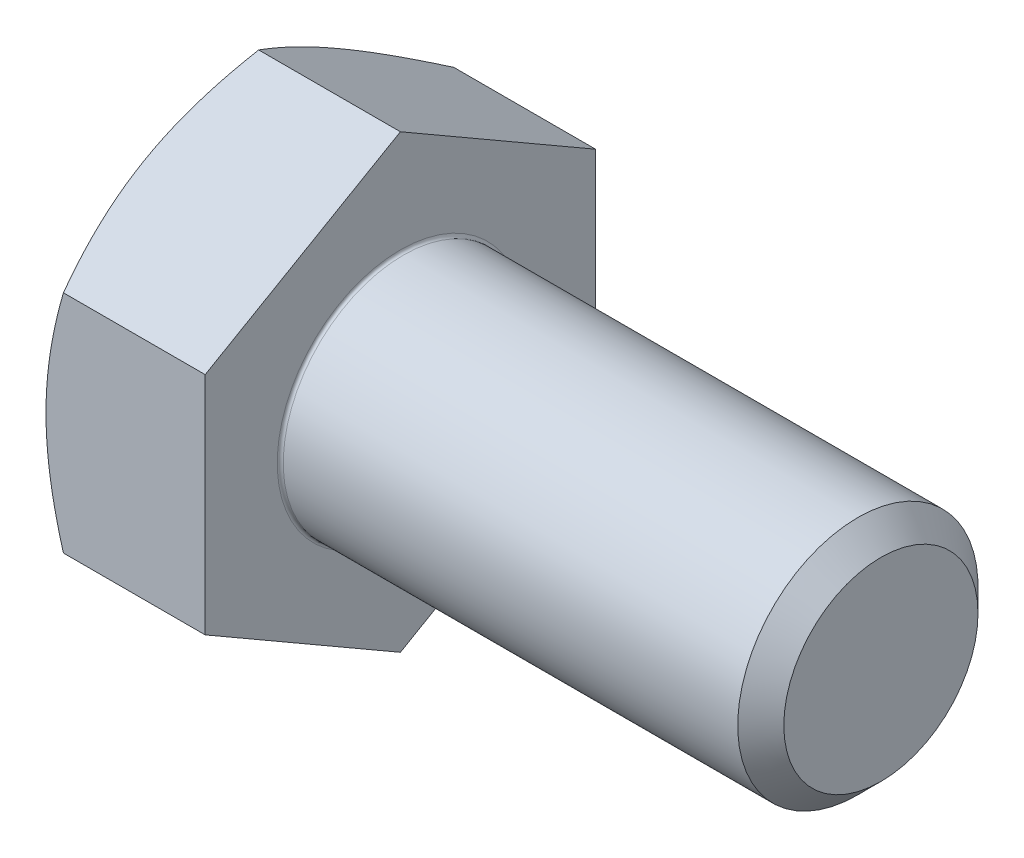
ISO-10303-21;
HEADER;
FILE_DESCRIPTION(('STEP AP214'),'2;1');
FILE_NAME('part.step','',(''),(''),'','','');
FILE_SCHEMA(('AUTOMOTIVE_DESIGN { 1 0 10303 214 1 1 1 1 }'));
ENDSEC;
DATA;
#1=APPLICATION_CONTEXT('core data for automotive mechanical design processes');
#2=APPLICATION_PROTOCOL_DEFINITION('international standard','automotive_design',2000,#1);
#3=PRODUCT_CONTEXT('',#1,'mechanical');
#4=PRODUCT('Part','Part','',(#3));
#5=PRODUCT_RELATED_PRODUCT_CATEGORY('part','',(#4));
#6=PRODUCT_DEFINITION_FORMATION('','',#4);
#7=PRODUCT_DEFINITION_CONTEXT('part definition',#1,'design');
#8=PRODUCT_DEFINITION('design','',#6,#7);
#9=PRODUCT_DEFINITION_SHAPE('','',#8);
#10=(LENGTH_UNIT() NAMED_UNIT(*) SI_UNIT(.MILLI.,.METRE.));
#11=(NAMED_UNIT(*) PLANE_ANGLE_UNIT() SI_UNIT($,.RADIAN.));
#12=(NAMED_UNIT(*) SI_UNIT($,.STERADIAN.) SOLID_ANGLE_UNIT());
#13=UNCERTAINTY_MEASURE_WITH_UNIT(LENGTH_MEASURE(1.E-05),#10,'distance_accuracy_value','');
#14=(GEOMETRIC_REPRESENTATION_CONTEXT(3) GLOBAL_UNCERTAINTY_ASSIGNED_CONTEXT((#13)) GLOBAL_UNIT_ASSIGNED_CONTEXT((#10,
#11,#12)) REPRESENTATION_CONTEXT('',''));
#15=CARTESIAN_POINT('',(0.,0.,0.));
#16=DIRECTION('',(0.,0.,1.));
#17=DIRECTION('',(1.,0.,0.));
#18=AXIS2_PLACEMENT_3D('',#15,#16,#17);
#19=CARTESIAN_POINT('',(-5.3,0.,0.));
#20=DIRECTION('',(1.,0.,0.));
#21=DIRECTION('',(0.,0.,1.));
#22=AXIS2_PLACEMENT_3D('',#19,#20,#21);
#23=PLANE('',#22);
#24=CARTESIAN_POINT('',(-5.3,0.,0.));
#25=DIRECTION('',(-1.,0.,0.));
#26=DIRECTION('',(0.,1.,0.));
#27=AXIS2_PLACEMENT_3D('',#24,#25,#26);
#28=CIRCLE('',#27,6.5);
#29=CARTESIAN_POINT('',(-5.3,5.62916512459885,-3.25));
#30=VERTEX_POINT('',#29);
#31=CARTESIAN_POINT('',(-5.3,0.,-6.5));
#32=VERTEX_POINT('',#31);
#33=EDGE_CURVE('E145',#30,#32,#28,.T.);
#34=ORIENTED_EDGE('',*,*,#33,.T.);
#35=CARTESIAN_POINT('',(-5.3,0.,0.));
#36=DIRECTION('',(-1.,0.,0.));
#37=DIRECTION('',(0.,1.,0.));
#38=AXIS2_PLACEMENT_3D('',#35,#36,#37);
#39=CIRCLE('',#38,6.5);
#40=CARTESIAN_POINT('',(-5.3,-5.62916512459885,-3.25));
#41=VERTEX_POINT('',#40);
#42=EDGE_CURVE('E218',#32,#41,#39,.T.);
#43=ORIENTED_EDGE('',*,*,#42,.T.);
#44=CARTESIAN_POINT('',(-5.3,0.,0.));
#45=DIRECTION('',(-1.,0.,0.));
#46=DIRECTION('',(0.,1.,0.));
#47=AXIS2_PLACEMENT_3D('',#44,#45,#46);
#48=CIRCLE('',#47,6.5);
#49=CARTESIAN_POINT('',(-5.3,-5.62916512459885,3.25));
#50=VERTEX_POINT('',#49);
#51=EDGE_CURVE('E187',#41,#50,#48,.T.);
#52=ORIENTED_EDGE('',*,*,#51,.T.);
#53=CARTESIAN_POINT('',(-5.3,0.,0.));
#54=DIRECTION('',(-1.,0.,0.));
#55=DIRECTION('',(0.,1.,0.));
#56=AXIS2_PLACEMENT_3D('',#53,#54,#55);
#57=CIRCLE('',#56,6.5);
#58=CARTESIAN_POINT('',(-5.3,0.,6.5));
#59=VERTEX_POINT('',#58);
#60=EDGE_CURVE('E20',#50,#59,#57,.T.);
#61=ORIENTED_EDGE('',*,*,#60,.T.);
#62=CARTESIAN_POINT('',(-5.3,0.,0.));
#63=DIRECTION('',(-1.,0.,0.));
#64=DIRECTION('',(0.,1.,0.));
#65=AXIS2_PLACEMENT_3D('',#62,#63,#64);
#66=CIRCLE('',#65,6.5);
#67=CARTESIAN_POINT('',(-5.3,5.62916512459885,3.25));
#68=VERTEX_POINT('',#67);
#69=EDGE_CURVE('E158',#59,#68,#66,.T.);
#70=ORIENTED_EDGE('',*,*,#69,.T.);
#71=CARTESIAN_POINT('',(-5.3,0.,0.));
#72=DIRECTION('',(-1.,0.,0.));
#73=DIRECTION('',(0.,1.,0.));
#74=AXIS2_PLACEMENT_3D('',#71,#72,#73);
#75=CIRCLE('',#74,6.5);
#76=EDGE_CURVE('E155',#68,#30,#75,.T.);
#77=ORIENTED_EDGE('',*,*,#76,.T.);
#78=EDGE_LOOP('',(#34,#43,#52,#61,#70,#77));
#79=FACE_BOUND('',#78,.T.);
#80=ADVANCED_FACE('F16',(#79),#23,.F.);
#81=CARTESIAN_POINT('',(0.,7.50555349946513,0.));
#82=DIRECTION('',(0.,0.866025403784438,0.5));
#83=DIRECTION('',(1.,0.,0.));
#84=AXIS2_PLACEMENT_3D('',#81,#82,#83);
#85=PLANE('',#84);
#86=CARTESIAN_POINT('',(-5.3,5.62916512459885,3.25));
#87=CARTESIAN_POINT('',(-5.3,4.75833024919771,4.75833024919769));
#88=CARTESIAN_POINT('',(-4.71944341639924,3.75277674973256,6.5));
#89=(BOUNDED_CURVE() B_SPLINE_CURVE(2,(#86,#87,#88),.UNSPECIFIED.,.F.,
.F.) B_SPLINE_CURVE_WITH_KNOTS((3,3),(0.439000868202294,0.827027033445395),
.UNSPECIFIED.) CURVE() GEOMETRIC_REPRESENTATION_ITEM() RATIONAL_B_SPLINE_CURVE((1.,
1.04314139574018,1.0100187493574)) REPRESENTATION_ITEM(''));
#90=CARTESIAN_POINT('',(-4.71944341639924,3.75277674973256,6.5));
#91=VERTEX_POINT('',#90);
#92=EDGE_CURVE('E217',#68,#91,#89,.T.);
#93=ORIENTED_EDGE('',*,*,#92,.T.);
#94=DIRECTION('',(-1.,0.,0.));
#95=VECTOR('',#94,1.);
#96=CARTESIAN_POINT('',(0.,3.75277674973256,6.5));
#97=LINE('',#96,#95);
#98=CARTESIAN_POINT('',(0.,3.75277674973256,6.5));
#99=VERTEX_POINT('',#98);
#100=EDGE_CURVE('E27',#99,#91,#97,.T.);
#101=ORIENTED_EDGE('',*,*,#100,.F.);
#102=DIRECTION('',(0.,-0.5,0.866025403784438));
#103=VECTOR('',#102,1.);
#104=CARTESIAN_POINT('',(0.,7.50555349946513,0.));
#105=LINE('',#104,#103);
#106=CARTESIAN_POINT('',(0.,7.50555349946513,0.));
#107=VERTEX_POINT('',#106);
#108=EDGE_CURVE('E206',#107,#99,#105,.T.);
#109=ORIENTED_EDGE('',*,*,#108,.F.);
#110=DIRECTION('',(-1.,0.,0.));
#111=VECTOR('',#110,1.);
#112=CARTESIAN_POINT('',(0.,7.50555349946513,0.));
#113=LINE('',#112,#111);
#114=CARTESIAN_POINT('',(-4.71944341639924,7.50555349946513,0.));
#115=VERTEX_POINT('',#114);
#116=EDGE_CURVE('E11',#107,#115,#113,.T.);
#117=ORIENTED_EDGE('',*,*,#116,.T.);
#118=CARTESIAN_POINT('',(-4.71944341639924,7.50555349946513,0.));
#119=CARTESIAN_POINT('',(-5.3,6.5,1.74166975080231));
#120=CARTESIAN_POINT('',(-5.3,5.62916512459885,3.25));
#121=(BOUNDED_CURVE() B_SPLINE_CURVE(2,(#118,#119,#120),.UNSPECIFIED.,.F.,
.F.) B_SPLINE_CURVE_WITH_KNOTS((3,3),(0.050974702959193,0.439000868202294),
.UNSPECIFIED.) CURVE() GEOMETRIC_REPRESENTATION_ITEM() RATIONAL_B_SPLINE_CURVE((1.01001874935741,
1.04314139574019,1.)) REPRESENTATION_ITEM(''));
#122=EDGE_CURVE('E165',#115,#68,#121,.T.);
#123=ORIENTED_EDGE('',*,*,#122,.T.);
#124=EDGE_LOOP('',(#93,#101,#109,#117,#123));
#125=FACE_BOUND('',#124,.T.);
#126=ADVANCED_FACE('F290',(#125),#85,.T.);
#127=CARTESIAN_POINT('',(0.,3.75277674973257,-6.5));
#128=DIRECTION('',(0.,0.866025403784439,-0.5));
#129=DIRECTION('',(-1.,0.,0.));
#130=AXIS2_PLACEMENT_3D('',#127,#128,#129);
#131=PLANE('',#130);
#132=CARTESIAN_POINT('',(-5.3,5.62916512459885,-3.25));
#133=CARTESIAN_POINT('',(-5.3,6.49999999999999,-1.7416697508023));
#134=CARTESIAN_POINT('',(-4.71944341639924,7.50555349946513,0.));
#135=(BOUNDED_CURVE() B_SPLINE_CURVE(2,(#132,#133,#134),.UNSPECIFIED.,.F.,
.F.) B_SPLINE_CURVE_WITH_KNOTS((3,3),(0.439000868202294,0.827027033445395),
.UNSPECIFIED.) CURVE() GEOMETRIC_REPRESENTATION_ITEM() RATIONAL_B_SPLINE_CURVE((1.,
1.04314139574018,1.0100187493574)) REPRESENTATION_ITEM(''));
#136=EDGE_CURVE('E138',#30,#115,#135,.T.);
#137=ORIENTED_EDGE('',*,*,#136,.T.);
#138=ORIENTED_EDGE('',*,*,#116,.F.);
#139=DIRECTION('',(0.,0.5,0.866025403784439));
#140=VECTOR('',#139,1.);
#141=CARTESIAN_POINT('',(0.,3.75277674973257,-6.5));
#142=LINE('',#141,#140);
#143=CARTESIAN_POINT('',(0.,3.75277674973257,-6.5));
#144=VERTEX_POINT('',#143);
#145=EDGE_CURVE('E237',#144,#107,#142,.T.);
#146=ORIENTED_EDGE('',*,*,#145,.F.);
#147=DIRECTION('',(-1.,0.,0.));
#148=VECTOR('',#147,1.);
#149=CARTESIAN_POINT('',(0.,3.75277674973257,-6.5));
#150=LINE('',#149,#148);
#151=CARTESIAN_POINT('',(-4.71944341639924,3.75277674973257,-6.5));
#152=VERTEX_POINT('',#151);
#153=EDGE_CURVE('E41',#144,#152,#150,.T.);
#154=ORIENTED_EDGE('',*,*,#153,.T.);
#155=CARTESIAN_POINT('',(-4.71944341639924,3.75277674973257,-6.49999999999999));
#156=CARTESIAN_POINT('',(-5.3,4.75833024919771,-4.75833024919768));
#157=CARTESIAN_POINT('',(-5.3,5.62916512459885,-3.25));
#158=(BOUNDED_CURVE() B_SPLINE_CURVE(2,(#155,#156,#157),.UNSPECIFIED.,.F.,
.F.) B_SPLINE_CURVE_WITH_KNOTS((3,3),(0.0509747029591937,0.439000868202294),
.UNSPECIFIED.) CURVE() GEOMETRIC_REPRESENTATION_ITEM() RATIONAL_B_SPLINE_CURVE((1.0100187493574,
1.04314139574017,1.)) REPRESENTATION_ITEM(''));
#159=EDGE_CURVE('E134',#152,#30,#158,.T.);
#160=ORIENTED_EDGE('',*,*,#159,.T.);
#161=EDGE_LOOP('',(#137,#138,#146,#154,#160));
#162=FACE_BOUND('',#161,.T.);
#163=ADVANCED_FACE('F136',(#162),#131,.T.);
#164=CARTESIAN_POINT('',(0.,3.75277674973256,6.5));
#165=DIRECTION('',(0.,0.,1.));
#166=DIRECTION('',(0.,-1.,0.));
#167=AXIS2_PLACEMENT_3D('',#164,#165,#166);
#168=PLANE('',#167);
#169=CARTESIAN_POINT('',(-5.3,0.,6.5));
#170=CARTESIAN_POINT('',(-5.3,-1.74166975080229,6.5));
#171=CARTESIAN_POINT('',(-4.71944341639924,-3.75277674973257,6.49999999999999));
#172=(BOUNDED_CURVE() B_SPLINE_CURVE(2,(#169,#170,#171),.UNSPECIFIED.,.F.,
.F.) B_SPLINE_CURVE_WITH_KNOTS((3,3),(0.439000868202295,0.827027033445395),
.UNSPECIFIED.) CURVE() GEOMETRIC_REPRESENTATION_ITEM() RATIONAL_B_SPLINE_CURVE((1.,
1.04314139574018,1.0100187493574)) REPRESENTATION_ITEM(''));
#173=CARTESIAN_POINT('',(-4.71944341639924,-3.75277674973257,6.5));
#174=VERTEX_POINT('',#173);
#175=EDGE_CURVE('E192',#59,#174,#172,.T.);
#176=ORIENTED_EDGE('',*,*,#175,.T.);
#177=DIRECTION('',(-1.,0.,0.));
#178=VECTOR('',#177,1.);
#179=CARTESIAN_POINT('',(0.,-3.75277674973257,6.5));
#180=LINE('',#179,#178);
#181=CARTESIAN_POINT('',(0.,-3.75277674973257,6.5));
#182=VERTEX_POINT('',#181);
#183=EDGE_CURVE('E112',#182,#174,#180,.T.);
#184=ORIENTED_EDGE('',*,*,#183,.F.);
#185=DIRECTION('',(0.,-1.,0.));
#186=VECTOR('',#185,1.);
#187=CARTESIAN_POINT('',(0.,3.75277674973256,6.5));
#188=LINE('',#187,#186);
#189=EDGE_CURVE('E198',#99,#182,#188,.T.);
#190=ORIENTED_EDGE('',*,*,#189,.F.);
#191=ORIENTED_EDGE('',*,*,#100,.T.);
#192=CARTESIAN_POINT('',(-4.71944341639924,3.75277674973256,6.5));
#193=CARTESIAN_POINT('',(-5.3,1.74166975080229,6.50000000000001));
#194=CARTESIAN_POINT('',(-5.3,0.,6.5));
#195=(BOUNDED_CURVE() B_SPLINE_CURVE(2,(#192,#193,#194),.UNSPECIFIED.,.F.,
.F.) B_SPLINE_CURVE_WITH_KNOTS((3,3),(0.0509747029591941,0.439000868202295),
.UNSPECIFIED.) CURVE() GEOMETRIC_REPRESENTATION_ITEM() RATIONAL_B_SPLINE_CURVE((1.01001874935741,
1.04314139574019,1.)) REPRESENTATION_ITEM(''));
#196=EDGE_CURVE('E162',#91,#59,#195,.T.);
#197=ORIENTED_EDGE('',*,*,#196,.T.);
#198=EDGE_LOOP('',(#176,#184,#190,#191,#197));
#199=FACE_BOUND('',#198,.T.);
#200=ADVANCED_FACE('F299',(#199),#168,.T.);
#201=CARTESIAN_POINT('',(0.,-3.75277674973256,-6.5));
#202=DIRECTION('',(0.,0.,-1.));
#203=DIRECTION('',(-1.,0.,0.));
#204=AXIS2_PLACEMENT_3D('',#201,#202,#203);
#205=PLANE('',#204);
#206=CARTESIAN_POINT('',(-4.71944341639924,-3.75277674973256,-6.5));
#207=CARTESIAN_POINT('',(-5.3,-1.74166975080228,-6.50000000000001));
#208=CARTESIAN_POINT('',(-5.3,0.,-6.5));
#209=(BOUNDED_CURVE() B_SPLINE_CURVE(2,(#206,#207,#208),.UNSPECIFIED.,.F.,
.F.) B_SPLINE_CURVE_WITH_KNOTS((3,3),(0.0509747029591942,0.439000868202295),
.UNSPECIFIED.) CURVE() GEOMETRIC_REPRESENTATION_ITEM() RATIONAL_B_SPLINE_CURVE((1.0100187493574,
1.04314139574017,1.)) REPRESENTATION_ITEM(''));
#210=CARTESIAN_POINT('',(-4.71944341639924,-3.75277674973256,-6.5));
#211=VERTEX_POINT('',#210);
#212=EDGE_CURVE('E221',#211,#32,#209,.T.);
#213=ORIENTED_EDGE('',*,*,#212,.T.);
#214=CARTESIAN_POINT('',(-5.3,0.,-6.5));
#215=CARTESIAN_POINT('',(-5.3,1.74166975080229,-6.49999999999999));
#216=CARTESIAN_POINT('',(-4.71944341639924,3.75277674973257,-6.49999999999999));
#217=(BOUNDED_CURVE() B_SPLINE_CURVE(2,(#214,#215,#216),.UNSPECIFIED.,.F.,
.F.) B_SPLINE_CURVE_WITH_KNOTS((3,3),(0.439000868202295,0.827027033445395),
.UNSPECIFIED.) CURVE() GEOMETRIC_REPRESENTATION_ITEM() RATIONAL_B_SPLINE_CURVE((1.,
1.04314139574018,1.0100187493574)) REPRESENTATION_ITEM(''));
#218=EDGE_CURVE('E149',#32,#152,#217,.T.);
#219=ORIENTED_EDGE('',*,*,#218,.T.);
#220=ORIENTED_EDGE('',*,*,#153,.F.);
#221=DIRECTION('',(0.,1.,0.));
#222=VECTOR('',#221,1.);
#223=CARTESIAN_POINT('',(0.,-3.75277674973256,-6.5));
#224=LINE('',#223,#222);
#225=CARTESIAN_POINT('',(0.,-3.75277674973256,-6.5));
#226=VERTEX_POINT('',#225);
#227=EDGE_CURVE('E230',#226,#144,#224,.T.);
#228=ORIENTED_EDGE('',*,*,#227,.F.);
#229=DIRECTION('',(-1.,0.,0.));
#230=VECTOR('',#229,1.);
#231=CARTESIAN_POINT('',(0.,-3.75277674973256,-6.5));
#232=LINE('',#231,#230);
#233=EDGE_CURVE('E252',#226,#211,#232,.T.);
#234=ORIENTED_EDGE('',*,*,#233,.T.);
#235=EDGE_LOOP('',(#213,#219,#220,#228,#234));
#236=FACE_BOUND('',#235,.T.);
#237=ADVANCED_FACE('F309',(#236),#205,.T.);
#238=CARTESIAN_POINT('',(0.,-7.50555349946513,0.));
#239=DIRECTION('',(0.,-0.866025403784439,-0.5));
#240=DIRECTION('',(0.,0.5,-0.866025403784439));
#241=AXIS2_PLACEMENT_3D('',#238,#239,#240);
#242=PLANE('',#241);
#243=CARTESIAN_POINT('',(-4.71944341639924,-7.50555349946513,0.));
#244=CARTESIAN_POINT('',(-5.3,-6.5,-1.74166975080231));
#245=CARTESIAN_POINT('',(-5.3,-5.62916512459885,-3.25));
#246=(BOUNDED_CURVE() B_SPLINE_CURVE(2,(#243,#244,#245),.UNSPECIFIED.,.F.,
.F.) B_SPLINE_CURVE_WITH_KNOTS((3,3),(0.0509747029591947,0.439000868202295),
.UNSPECIFIED.) CURVE() GEOMETRIC_REPRESENTATION_ITEM() RATIONAL_B_SPLINE_CURVE((1.0100187493574,
1.04314139574017,1.)) REPRESENTATION_ITEM(''));
#247=CARTESIAN_POINT('',(-4.71944341639924,-7.50555349946513,0.));
#248=VERTEX_POINT('',#247);
#249=EDGE_CURVE('E341',#248,#41,#246,.T.);
#250=ORIENTED_EDGE('',*,*,#249,.T.);
#251=CARTESIAN_POINT('',(-5.3,-5.62916512459885,-3.25));
#252=CARTESIAN_POINT('',(-5.3,-4.7583302491977,-4.7583302491977));
#253=CARTESIAN_POINT('',(-4.71944341639924,-3.75277674973256,-6.5));
#254=(BOUNDED_CURVE() B_SPLINE_CURVE(2,(#251,#252,#253),.UNSPECIFIED.,.F.,
.F.) B_SPLINE_CURVE_WITH_KNOTS((3,3),(0.439000868202295,0.827027033445396),
.UNSPECIFIED.) CURVE() GEOMETRIC_REPRESENTATION_ITEM() RATIONAL_B_SPLINE_CURVE((1.,
1.04314139574018,1.0100187493574)) REPRESENTATION_ITEM(''));
#255=EDGE_CURVE('E222',#41,#211,#254,.T.);
#256=ORIENTED_EDGE('',*,*,#255,.T.);
#257=ORIENTED_EDGE('',*,*,#233,.F.);
#258=DIRECTION('',(0.,0.5,-0.866025403784438));
#259=VECTOR('',#258,1.);
#260=CARTESIAN_POINT('',(0.,-7.50555349946513,0.));
#261=LINE('',#260,#259);
#262=CARTESIAN_POINT('',(0.,-7.50555349946513,0.));
#263=VERTEX_POINT('',#262);
#264=EDGE_CURVE('E214',#263,#226,#261,.T.);
#265=ORIENTED_EDGE('',*,*,#264,.F.);
#266=DIRECTION('',(-1.,0.,0.));
#267=VECTOR('',#266,1.);
#268=CARTESIAN_POINT('',(0.,-7.50555349946513,0.));
#269=LINE('',#268,#267);
#270=EDGE_CURVE('E144',#263,#248,#269,.T.);
#271=ORIENTED_EDGE('',*,*,#270,.T.);
#272=EDGE_LOOP('',(#250,#256,#257,#265,#271));
#273=FACE_BOUND('',#272,.T.);
#274=ADVANCED_FACE('F313',(#273),#242,.T.);
#275=CARTESIAN_POINT('',(0.,-3.75277674973257,6.5));
#276=DIRECTION('',(0.,-0.866025403784439,0.5));
#277=DIRECTION('',(-1.,0.,0.));
#278=AXIS2_PLACEMENT_3D('',#275,#276,#277);
#279=PLANE('',#278);
#280=CARTESIAN_POINT('',(-4.71944341639924,-3.75277674973257,6.49999999999999));
#281=CARTESIAN_POINT('',(-5.30000000000001,-4.75833024919771,4.75833024919769));
#282=CARTESIAN_POINT('',(-5.3,-5.62916512459885,3.25));
#283=(BOUNDED_CURVE() B_SPLINE_CURVE(2,(#280,#281,#282),.UNSPECIFIED.,.F.,
.F.) B_SPLINE_CURVE_WITH_KNOTS((3,3),(0.0509747029591935,0.439000868202295),
.UNSPECIFIED.) CURVE() GEOMETRIC_REPRESENTATION_ITEM() RATIONAL_B_SPLINE_CURVE((1.01001874935741,
1.04314139574019,1.)) REPRESENTATION_ITEM(''));
#284=EDGE_CURVE('E197',#174,#50,#283,.T.);
#285=ORIENTED_EDGE('',*,*,#284,.T.);
#286=CARTESIAN_POINT('',(-5.3,-5.62916512459885,3.25));
#287=CARTESIAN_POINT('',(-5.30000000000001,-6.49999999999999,1.74166975080231));
#288=CARTESIAN_POINT('',(-4.71944341639924,-7.50555349946513,0.));
#289=(BOUNDED_CURVE() B_SPLINE_CURVE(2,(#286,#287,#288),.UNSPECIFIED.,.F.,
.F.) B_SPLINE_CURVE_WITH_KNOTS((3,3),(0.439000868202295,0.827027033445396),
.UNSPECIFIED.) CURVE() GEOMETRIC_REPRESENTATION_ITEM() RATIONAL_B_SPLINE_CURVE((1.,
1.04314139574018,1.0100187493574)) REPRESENTATION_ITEM(''));
#290=EDGE_CURVE('E179',#50,#248,#289,.T.);
#291=ORIENTED_EDGE('',*,*,#290,.T.);
#292=ORIENTED_EDGE('',*,*,#270,.F.);
#293=DIRECTION('',(0.,-0.5,-0.866025403784439));
#294=VECTOR('',#293,1.);
#295=CARTESIAN_POINT('',(0.,-3.75277674973257,6.5));
#296=LINE('',#295,#294);
#297=EDGE_CURVE('E205',#182,#263,#296,.T.);
#298=ORIENTED_EDGE('',*,*,#297,.F.);
#299=ORIENTED_EDGE('',*,*,#183,.T.);
#300=EDGE_LOOP('',(#285,#291,#292,#298,#299));
#301=FACE_BOUND('',#300,.T.);
#302=ADVANCED_FACE('F381',(#301),#279,.T.);
#303=CARTESIAN_POINT('',(-4.92472232502675,0.,0.));
#304=DIRECTION('',(1.,0.,0.));
#305=DIRECTION('',(0.,1.,0.));
#306=AXIS2_PLACEMENT_3D('',#303,#304,#305);
#307=CONICAL_SURFACE('',#306,7.15,1.0471975512);
#308=ORIENTED_EDGE('',*,*,#218,.F.);
#309=ORIENTED_EDGE('',*,*,#33,.F.);
#310=ORIENTED_EDGE('',*,*,#159,.F.);
#311=EDGE_LOOP('',(#308,#309,#310));
#312=FACE_BOUND('',#311,.T.);
#313=ADVANCED_FACE('F148',(#312),#307,.T.);
#314=CARTESIAN_POINT('',(-4.92472232502675,0.,0.));
#315=DIRECTION('',(1.,0.,0.));
#316=DIRECTION('',(0.,1.,0.));
#317=AXIS2_PLACEMENT_3D('',#314,#315,#316);
#318=CONICAL_SURFACE('',#317,7.15,1.0471975512);
#319=ORIENTED_EDGE('',*,*,#255,.F.);
#320=ORIENTED_EDGE('',*,*,#42,.F.);
#321=ORIENTED_EDGE('',*,*,#212,.F.);
#322=EDGE_LOOP('',(#319,#320,#321));
#323=FACE_BOUND('',#322,.T.);
#324=ADVANCED_FACE('F377',(#323),#318,.T.);
#325=CARTESIAN_POINT('',(-4.92472232502675,0.,0.));
#326=DIRECTION('',(1.,0.,0.));
#327=DIRECTION('',(0.,1.,0.));
#328=AXIS2_PLACEMENT_3D('',#325,#326,#327);
#329=CONICAL_SURFACE('',#328,7.15,1.0471975512);
#330=ORIENTED_EDGE('',*,*,#290,.F.);
#331=ORIENTED_EDGE('',*,*,#51,.F.);
#332=ORIENTED_EDGE('',*,*,#249,.F.);
#333=EDGE_LOOP('',(#330,#331,#332));
#334=FACE_BOUND('',#333,.T.);
#335=ADVANCED_FACE('F380',(#334),#329,.T.);
#336=CARTESIAN_POINT('',(-4.92472232502675,0.,0.));
#337=DIRECTION('',(1.,0.,0.));
#338=DIRECTION('',(0.,1.,0.));
#339=AXIS2_PLACEMENT_3D('',#336,#337,#338);
#340=CONICAL_SURFACE('',#339,7.15,1.0471975512);
#341=ORIENTED_EDGE('',*,*,#284,.F.);
#342=ORIENTED_EDGE('',*,*,#175,.F.);
#343=ORIENTED_EDGE('',*,*,#60,.F.);
#344=EDGE_LOOP('',(#341,#342,#343));
#345=FACE_BOUND('',#344,.T.);
#346=ADVANCED_FACE('F321',(#345),#340,.T.);
#347=CARTESIAN_POINT('',(-4.92472232502675,0.,0.));
#348=DIRECTION('',(1.,0.,0.));
#349=DIRECTION('',(0.,1.,0.));
#350=AXIS2_PLACEMENT_3D('',#347,#348,#349);
#351=CONICAL_SURFACE('',#350,7.15,1.0471975512);
#352=ORIENTED_EDGE('',*,*,#196,.F.);
#353=ORIENTED_EDGE('',*,*,#92,.F.);
#354=ORIENTED_EDGE('',*,*,#69,.F.);
#355=EDGE_LOOP('',(#352,#353,#354));
#356=FACE_BOUND('',#355,.T.);
#357=ADVANCED_FACE('F391',(#356),#351,.T.);
#358=CARTESIAN_POINT('',(-4.92472232502675,0.,0.));
#359=DIRECTION('',(1.,0.,0.));
#360=DIRECTION('',(0.,1.,0.));
#361=AXIS2_PLACEMENT_3D('',#358,#359,#360);
#362=CONICAL_SURFACE('',#361,7.15,1.0471975512);
#363=ORIENTED_EDGE('',*,*,#122,.F.);
#364=ORIENTED_EDGE('',*,*,#136,.F.);
#365=ORIENTED_EDGE('',*,*,#76,.F.);
#366=EDGE_LOOP('',(#363,#364,#365));
#367=FACE_BOUND('',#366,.T.);
#368=ADVANCED_FACE('F164',(#367),#362,.T.);
#369=CARTESIAN_POINT('',(16.,2.,0.));
#370=DIRECTION('',(1.,0.,0.));
#371=DIRECTION('',(0.,1.,0.));
#372=AXIS2_PLACEMENT_3D('',#369,#370,#371);
#373=PLANE('',#372);
#374=CARTESIAN_POINT('',(16.,0.,0.));
#375=DIRECTION('',(-1.,0.,0.));
#376=DIRECTION('',(0.,-1.,0.));
#377=AXIS2_PLACEMENT_3D('',#374,#375,#376);
#378=CIRCLE('',#377,3.2331875);
#379=CARTESIAN_POINT('',(16.,3.2331875,0.));
#380=VERTEX_POINT('',#379);
#381=EDGE_CURVE('E100',#380,#380,#378,.T.);
#382=ORIENTED_EDGE('',*,*,#381,.F.);
#383=EDGE_LOOP('',(#382));
#384=FACE_BOUND('',#383,.T.);
#385=ADVANCED_FACE('F304',(#384),#373,.T.);
#386=CARTESIAN_POINT('',(15.61654375,0.,0.));
#387=DIRECTION('',(-1.,0.,0.));
#388=DIRECTION('',(0.,-1.,0.));
#389=AXIS2_PLACEMENT_3D('',#386,#387,#388);
#390=CONICAL_SURFACE('',#389,3.61659375,0.785332962663322);
#391=ORIENTED_EDGE('',*,*,#381,.T.);
#392=EDGE_LOOP('',(#391));
#393=FACE_BOUND('',#392,.T.);
#394=CARTESIAN_POINT('',(15.2330875,0.,0.));
#395=DIRECTION('',(1.,0.,0.));
#396=DIRECTION('',(0.,-1.,0.));
#397=AXIS2_PLACEMENT_3D('',#394,#395,#396);
#398=CIRCLE('',#397,4.);
#399=CARTESIAN_POINT('',(15.2330875,4.,0.));
#400=VERTEX_POINT('',#399);
#401=EDGE_CURVE('E210',#400,#400,#398,.T.);
#402=ORIENTED_EDGE('',*,*,#401,.T.);
#403=EDGE_LOOP('',(#402));
#404=FACE_BOUND('',#403,.T.);
#405=ADVANCED_FACE('F18',(#393,#404),#390,.T.);
#406=CARTESIAN_POINT('',(0.,0.,0.));
#407=DIRECTION('',(1.,0.,0.));
#408=DIRECTION('',(0.,0.,1.));
#409=AXIS2_PLACEMENT_3D('',#406,#407,#408);
#410=PLANE('',#409);
#411=CARTESIAN_POINT('',(0.,0.,0.));
#412=DIRECTION('',(1.,0.,0.));
#413=DIRECTION('',(0.,-1.,0.));
#414=AXIS2_PLACEMENT_3D('',#411,#412,#413);
#415=CIRCLE('',#414,4.1);
#416=CARTESIAN_POINT('',(0.,4.1,0.));
#417=VERTEX_POINT('',#416);
#418=EDGE_CURVE('E177',#417,#417,#415,.T.);
#419=ORIENTED_EDGE('',*,*,#418,.F.);
#420=EDGE_LOOP('',(#419));
#421=FACE_BOUND('',#420,.T.);
#422=ORIENTED_EDGE('',*,*,#108,.T.);
#423=ORIENTED_EDGE('',*,*,#189,.T.);
#424=ORIENTED_EDGE('',*,*,#297,.T.);
#425=ORIENTED_EDGE('',*,*,#264,.T.);
#426=ORIENTED_EDGE('',*,*,#227,.T.);
#427=ORIENTED_EDGE('',*,*,#145,.T.);
#428=EDGE_LOOP('',(#422,#423,#424,#425,#426,#427));
#429=FACE_BOUND('',#428,.T.);
#430=ADVANCED_FACE('F285',(#421,#429),#410,.T.);
#431=CARTESIAN_POINT('',(8.,0.,0.));
#432=DIRECTION('',(1.,0.,0.));
#433=DIRECTION('',(0.,1.,0.));
#434=AXIS2_PLACEMENT_3D('',#431,#432,#433);
#435=CYLINDRICAL_SURFACE('',#434,4.);
#436=CARTESIAN_POINT('',(0.1,0.,0.));
#437=DIRECTION('',(-1.,0.,0.));
#438=DIRECTION('',(0.,-1.,0.));
#439=AXIS2_PLACEMENT_3D('',#436,#437,#438);
#440=CIRCLE('',#439,4.);
#441=CARTESIAN_POINT('',(0.1,4.,0.));
#442=VERTEX_POINT('',#441);
#443=EDGE_CURVE('E269',#442,#442,#440,.T.);
#444=ORIENTED_EDGE('',*,*,#443,.F.);
#445=EDGE_LOOP('',(#444));
#446=FACE_BOUND('',#445,.T.);
#447=ORIENTED_EDGE('',*,*,#401,.F.);
#448=EDGE_LOOP('',(#447));
#449=FACE_BOUND('',#448,.T.);
#450=ADVANCED_FACE('F288',(#446,#449),#435,.T.);
#451=CARTESIAN_POINT('',(0.1,0.,0.));
#452=DIRECTION('',(1.,0.,0.));
#453=DIRECTION('',(0.,0.,-1.));
#454=AXIS2_PLACEMENT_3D('',#451,#452,#453);
#455=TOROIDAL_SURFACE('',#454,4.1,0.1);
#456=ORIENTED_EDGE('',*,*,#443,.T.);
#457=EDGE_LOOP('',(#456));
#458=FACE_BOUND('',#457,.T.);
#459=ORIENTED_EDGE('',*,*,#418,.T.);
#460=EDGE_LOOP('',(#459));
#461=FACE_BOUND('',#460,.T.);
#462=ADVANCED_FACE('F283',(#458,#461),#455,.F.);
#463=CLOSED_SHELL('',(#80,#126,#163,#200,#237,#274,#302,#313,#324,#335,#346,#357,#368,#385,#405,
#430,#450,#462));
#464=MANIFOLD_SOLID_BREP('B1',#463);
#465=ADVANCED_BREP_SHAPE_REPRESENTATION('',(#18,#464),#14);
#466=SHAPE_DEFINITION_REPRESENTATION(#9,#465);
ENDSEC;
END-ISO-10303-21;
